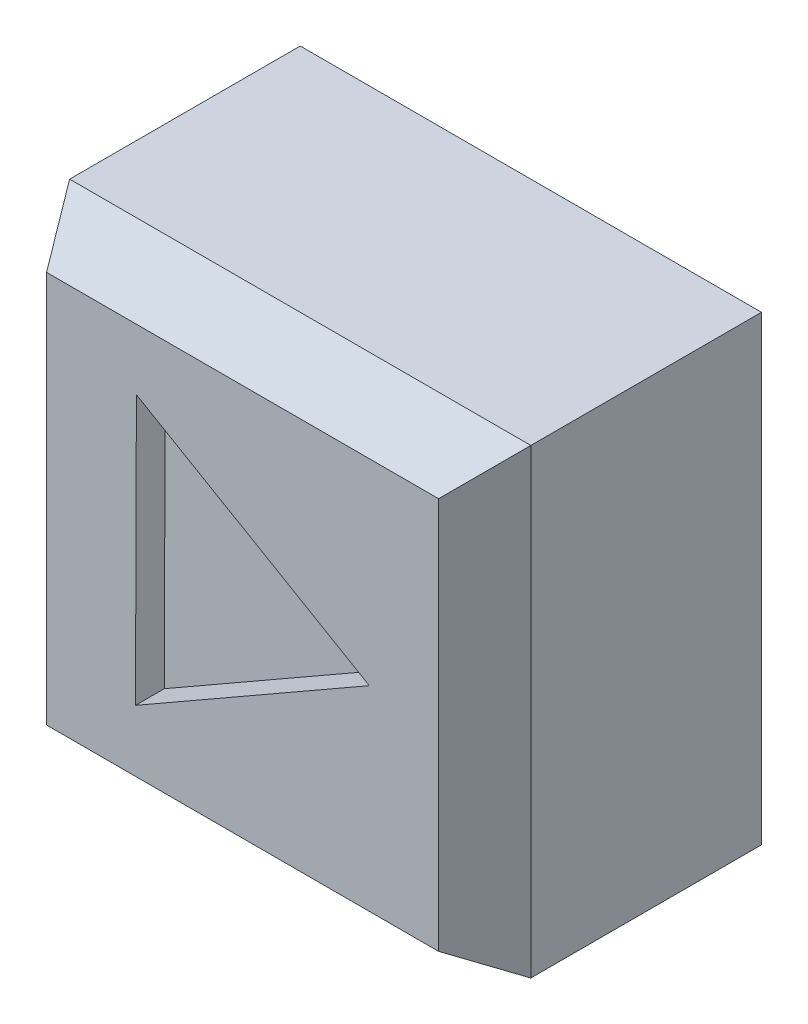
ISO-10303-21;
HEADER;
FILE_DESCRIPTION(('STEP AP214'),'2;1');
FILE_NAME('part.step','',(''),(''),'','','');
FILE_SCHEMA(('AUTOMOTIVE_DESIGN { 1 0 10303 214 1 1 1 1 }'));
ENDSEC;
DATA;
#1=APPLICATION_CONTEXT('core data for automotive mechanical design processes');
#2=APPLICATION_PROTOCOL_DEFINITION('international standard','automotive_design',2000,#1);
#3=PRODUCT_CONTEXT('',#1,'mechanical');
#4=PRODUCT('Part','Part','',(#3));
#5=PRODUCT_RELATED_PRODUCT_CATEGORY('part','',(#4));
#6=PRODUCT_DEFINITION_FORMATION('','',#4);
#7=PRODUCT_DEFINITION_CONTEXT('part definition',#1,'design');
#8=PRODUCT_DEFINITION('design','',#6,#7);
#9=PRODUCT_DEFINITION_SHAPE('','',#8);
#10=(LENGTH_UNIT() NAMED_UNIT(*) SI_UNIT(.MILLI.,.METRE.));
#11=(NAMED_UNIT(*) PLANE_ANGLE_UNIT() SI_UNIT($,.RADIAN.));
#12=(NAMED_UNIT(*) SI_UNIT($,.STERADIAN.) SOLID_ANGLE_UNIT());
#13=UNCERTAINTY_MEASURE_WITH_UNIT(LENGTH_MEASURE(1.E-05),#10,'distance_accuracy_value','');
#14=(GEOMETRIC_REPRESENTATION_CONTEXT(3) GLOBAL_UNCERTAINTY_ASSIGNED_CONTEXT((#13)) GLOBAL_UNIT_ASSIGNED_CONTEXT((#10,
#11,#12)) REPRESENTATION_CONTEXT('',''));
#15=CARTESIAN_POINT('',(0.,0.,0.));
#16=DIRECTION('',(0.,0.,1.));
#17=DIRECTION('',(1.,0.,0.));
#18=AXIS2_PLACEMENT_3D('',#15,#16,#17);
#19=CARTESIAN_POINT('',(0.,0.,10.));
#20=DIRECTION('',(1.,0.,0.));
#21=DIRECTION('',(0.,0.,-1.));
#22=AXIS2_PLACEMENT_3D('',#19,#20,#21);
#23=PLANE('',#22);
#24=DIRECTION('',(0.,0.,-1.));
#25=VECTOR('',#24,1.);
#26=CARTESIAN_POINT('',(0.,0.,10.));
#27=LINE('',#26,#25);
#28=CARTESIAN_POINT('',(0.,0.,8.));
#29=VERTEX_POINT('',#28);
#30=CARTESIAN_POINT('',(0.,0.,0.));
#31=VERTEX_POINT('',#30);
#32=EDGE_CURVE('E188',#29,#31,#27,.T.);
#33=ORIENTED_EDGE('',*,*,#32,.F.);
#34=DIRECTION('',(0.,1.,0.));
#35=VECTOR('',#34,1.);
#36=CARTESIAN_POINT('',(0.,0.,8.));
#37=LINE('',#36,#35);
#38=CARTESIAN_POINT('',(0.,16.,8.));
#39=VERTEX_POINT('',#38);
#40=EDGE_CURVE('E13',#29,#39,#37,.T.);
#41=ORIENTED_EDGE('',*,*,#40,.T.);
#42=DIRECTION('',(0.,0.,-1.));
#43=VECTOR('',#42,1.);
#44=CARTESIAN_POINT('',(0.,16.,10.));
#45=LINE('',#44,#43);
#46=CARTESIAN_POINT('',(0.,16.,0.));
#47=VERTEX_POINT('',#46);
#48=EDGE_CURVE('E179',#39,#47,#45,.T.);
#49=ORIENTED_EDGE('',*,*,#48,.T.);
#50=DIRECTION('',(0.,-1.,0.));
#51=VECTOR('',#50,1.);
#52=CARTESIAN_POINT('',(0.,0.,0.));
#53=LINE('',#52,#51);
#54=EDGE_CURVE('E161',#47,#31,#53,.T.);
#55=ORIENTED_EDGE('',*,*,#54,.T.);
#56=EDGE_LOOP('',(#33,#41,#49,#55));
#57=FACE_BOUND('',#56,.T.);
#58=ADVANCED_FACE('F48',(#57),#23,.F.);
#59=CARTESIAN_POINT('',(0.,0.,10.));
#60=DIRECTION('',(0.,1.,0.));
#61=DIRECTION('',(0.,0.,1.));
#62=AXIS2_PLACEMENT_3D('',#59,#60,#61);
#63=PLANE('',#62);
#64=DIRECTION('',(0.,0.,-1.));
#65=VECTOR('',#64,1.);
#66=CARTESIAN_POINT('',(16.,0.,10.));
#67=LINE('',#66,#65);
#68=CARTESIAN_POINT('',(16.,0.,8.));
#69=VERTEX_POINT('',#68);
#70=CARTESIAN_POINT('',(16.,0.,0.));
#71=VERTEX_POINT('',#70);
#72=EDGE_CURVE('E185',#69,#71,#67,.T.);
#73=ORIENTED_EDGE('',*,*,#72,.F.);
#74=DIRECTION('',(-1.,0.,0.));
#75=VECTOR('',#74,1.);
#76=CARTESIAN_POINT('',(0.,0.,8.));
#77=LINE('',#76,#75);
#78=EDGE_CURVE('E204',#69,#29,#77,.T.);
#79=ORIENTED_EDGE('',*,*,#78,.T.);
#80=ORIENTED_EDGE('',*,*,#32,.T.);
#81=DIRECTION('',(1.,0.,0.));
#82=VECTOR('',#81,1.);
#83=CARTESIAN_POINT('',(0.,0.,0.));
#84=LINE('',#83,#82);
#85=EDGE_CURVE('E167',#31,#71,#84,.T.);
#86=ORIENTED_EDGE('',*,*,#85,.T.);
#87=EDGE_LOOP('',(#73,#79,#80,#86));
#88=FACE_BOUND('',#87,.T.);
#89=ADVANCED_FACE('F241',(#88),#63,.F.);
#90=CARTESIAN_POINT('',(16.,0.,10.));
#91=DIRECTION('',(-1.,0.,0.));
#92=DIRECTION('',(0.,0.,1.));
#93=AXIS2_PLACEMENT_3D('',#90,#91,#92);
#94=PLANE('',#93);
#95=DIRECTION('',(0.,0.,-1.));
#96=VECTOR('',#95,1.);
#97=CARTESIAN_POINT('',(16.,16.,10.));
#98=LINE('',#97,#96);
#99=CARTESIAN_POINT('',(16.,16.,8.));
#100=VERTEX_POINT('',#99);
#101=CARTESIAN_POINT('',(16.,16.,0.));
#102=VERTEX_POINT('',#101);
#103=EDGE_CURVE('E182',#100,#102,#98,.T.);
#104=ORIENTED_EDGE('',*,*,#103,.F.);
#105=DIRECTION('',(0.,-1.,0.));
#106=VECTOR('',#105,1.);
#107=CARTESIAN_POINT('',(16.,0.,8.));
#108=LINE('',#107,#106);
#109=EDGE_CURVE('E208',#100,#69,#108,.T.);
#110=ORIENTED_EDGE('',*,*,#109,.T.);
#111=ORIENTED_EDGE('',*,*,#72,.T.);
#112=DIRECTION('',(0.,1.,0.));
#113=VECTOR('',#112,1.);
#114=CARTESIAN_POINT('',(16.,0.,0.));
#115=LINE('',#114,#113);
#116=EDGE_CURVE('E171',#71,#102,#115,.T.);
#117=ORIENTED_EDGE('',*,*,#116,.T.);
#118=EDGE_LOOP('',(#104,#110,#111,#117));
#119=FACE_BOUND('',#118,.T.);
#120=ADVANCED_FACE('F238',(#119),#94,.F.);
#121=CARTESIAN_POINT('',(0.,16.,10.));
#122=DIRECTION('',(0.,-1.,0.));
#123=DIRECTION('',(0.,0.,-1.));
#124=AXIS2_PLACEMENT_3D('',#121,#122,#123);
#125=PLANE('',#124);
#126=ORIENTED_EDGE('',*,*,#48,.F.);
#127=DIRECTION('',(1.,0.,0.));
#128=VECTOR('',#127,1.);
#129=CARTESIAN_POINT('',(0.,16.,8.));
#130=LINE('',#129,#128);
#131=EDGE_CURVE('E59',#39,#100,#130,.T.);
#132=ORIENTED_EDGE('',*,*,#131,.T.);
#133=ORIENTED_EDGE('',*,*,#103,.T.);
#134=DIRECTION('',(-1.,0.,0.));
#135=VECTOR('',#134,1.);
#136=CARTESIAN_POINT('',(0.,16.,0.));
#137=LINE('',#136,#135);
#138=EDGE_CURVE('E175',#102,#47,#137,.T.);
#139=ORIENTED_EDGE('',*,*,#138,.T.);
#140=EDGE_LOOP('',(#126,#132,#133,#139));
#141=FACE_BOUND('',#140,.T.);
#142=ADVANCED_FACE('F252',(#141),#125,.F.);
#143=CARTESIAN_POINT('',(0.,0.,10.));
#144=DIRECTION('',(0.,0.,-1.));
#145=DIRECTION('',(-1.,0.,0.));
#146=AXIS2_PLACEMENT_3D('',#143,#144,#145);
#147=PLANE('',#146);
#148=DIRECTION('',(0.,-1.,0.));
#149=VECTOR('',#148,1.);
#150=CARTESIAN_POINT('',(1.2,0.,10.));
#151=LINE('',#150,#149);
#152=CARTESIAN_POINT('',(1.2,14.8,10.));
#153=VERTEX_POINT('',#152);
#154=CARTESIAN_POINT('',(1.2,1.2,10.));
#155=VERTEX_POINT('',#154);
#156=EDGE_CURVE('E191',#153,#155,#151,.T.);
#157=ORIENTED_EDGE('',*,*,#156,.T.);
#158=DIRECTION('',(1.,0.,0.));
#159=VECTOR('',#158,1.);
#160=CARTESIAN_POINT('',(0.,1.2,10.));
#161=LINE('',#160,#159);
#162=CARTESIAN_POINT('',(14.8,1.2,10.));
#163=VERTEX_POINT('',#162);
#164=EDGE_CURVE('E200',#155,#163,#161,.T.);
#165=ORIENTED_EDGE('',*,*,#164,.T.);
#166=DIRECTION('',(0.,1.,0.));
#167=VECTOR('',#166,1.);
#168=CARTESIAN_POINT('',(14.8,0.,10.));
#169=LINE('',#168,#167);
#170=CARTESIAN_POINT('',(14.8,14.8,10.));
#171=VERTEX_POINT('',#170);
#172=EDGE_CURVE('E197',#163,#171,#169,.T.);
#173=ORIENTED_EDGE('',*,*,#172,.T.);
#174=DIRECTION('',(-1.,0.,0.));
#175=VECTOR('',#174,1.);
#176=CARTESIAN_POINT('',(0.,14.8,10.));
#177=LINE('',#176,#175);
#178=EDGE_CURVE('E194',#171,#153,#177,.T.);
#179=ORIENTED_EDGE('',*,*,#178,.T.);
#180=EDGE_LOOP('',(#157,#165,#173,#179));
#181=FACE_BOUND('',#180,.T.);
#182=DIRECTION('',(-0.00335376071122028,-0.999994376128732,0.));
#183=VECTOR('',#182,1.);
#184=CARTESIAN_POINT('',(4.31639020285282,12.6843598075923,10.));
#185=LINE('',#184,#183);
#186=CARTESIAN_POINT('',(4.31639020285282,12.6843598075923,10.));
#187=VERTEX_POINT('',#186);
#188=CARTESIAN_POINT('',(4.28503030473188,3.3337458380296,10.));
#189=VERTEX_POINT('',#188);
#190=EDGE_CURVE('E149',#187,#189,#185,.T.);
#191=ORIENTED_EDGE('',*,*,#190,.F.);
#192=DIRECTION('',(-0.864343653013443,0.502901630038497,0.));
#193=VECTOR('',#192,1.);
#194=CARTESIAN_POINT('',(12.3985794924153,7.98189435437812,10.));
#195=LINE('',#194,#193);
#196=CARTESIAN_POINT('',(12.3985794924153,7.98189435437812,10.));
#197=VERTEX_POINT('',#196);
#198=EDGE_CURVE('E128',#197,#187,#195,.T.);
#199=ORIENTED_EDGE('',*,*,#198,.F.);
#200=DIRECTION('',(0.867697413724663,0.497092746090235,0.));
#201=VECTOR('',#200,1.);
#202=CARTESIAN_POINT('',(4.28503030473188,3.3337458380296,10.));
#203=LINE('',#202,#201);
#204=EDGE_CURVE('E145',#189,#197,#203,.T.);
#205=ORIENTED_EDGE('',*,*,#204,.F.);
#206=EDGE_LOOP('',(#191,#199,#205));
#207=FACE_BOUND('',#206,.T.);
#208=ADVANCED_FACE('F248',(#181,#207),#147,.F.);
#209=CARTESIAN_POINT('',(0.,0.,0.));
#210=DIRECTION('',(0.,0.,-1.));
#211=DIRECTION('',(-1.,0.,0.));
#212=AXIS2_PLACEMENT_3D('',#209,#210,#211);
#213=PLANE('',#212);
#214=ORIENTED_EDGE('',*,*,#54,.F.);
#215=ORIENTED_EDGE('',*,*,#138,.F.);
#216=ORIENTED_EDGE('',*,*,#116,.F.);
#217=ORIENTED_EDGE('',*,*,#85,.F.);
#218=EDGE_LOOP('',(#214,#215,#216,#217));
#219=FACE_BOUND('',#218,.T.);
#220=ADVANCED_FACE('F251',(#219),#213,.T.);
#221=CARTESIAN_POINT('',(12.3985794924153,7.98189435437812,9.));
#222=DIRECTION('',(0.502901630038497,0.864343653013443,0.));
#223=DIRECTION('',(-0.864343653013443,0.502901630038497,0.));
#224=AXIS2_PLACEMENT_3D('',#221,#222,#223);
#225=PLANE('',#224);
#226=ORIENTED_EDGE('',*,*,#198,.T.);
#227=DIRECTION('',(0.,0.,1.));
#228=VECTOR('',#227,1.);
#229=CARTESIAN_POINT('',(4.31639020285282,12.6843598075923,9.));
#230=LINE('',#229,#228);
#231=CARTESIAN_POINT('',(4.31639020285282,12.6843598075923,9.));
#232=VERTEX_POINT('',#231);
#233=EDGE_CURVE('E121',#232,#187,#230,.T.);
#234=ORIENTED_EDGE('',*,*,#233,.F.);
#235=DIRECTION('',(-0.864343653013443,0.502901630038497,0.));
#236=VECTOR('',#235,1.);
#237=CARTESIAN_POINT('',(12.3985794924153,7.98189435437812,9.));
#238=LINE('',#237,#236);
#239=CARTESIAN_POINT('',(12.3985794924153,7.98189435437812,9.));
#240=VERTEX_POINT('',#239);
#241=EDGE_CURVE('E125',#240,#232,#238,.T.);
#242=ORIENTED_EDGE('',*,*,#241,.F.);
#243=DIRECTION('',(0.,0.,1.));
#244=VECTOR('',#243,1.);
#245=CARTESIAN_POINT('',(12.3985794924153,7.98189435437812,9.));
#246=LINE('',#245,#244);
#247=EDGE_CURVE('E158',#240,#197,#246,.T.);
#248=ORIENTED_EDGE('',*,*,#247,.T.);
#249=EDGE_LOOP('',(#226,#234,#242,#248));
#250=FACE_BOUND('',#249,.T.);
#251=ADVANCED_FACE('F123',(#250),#225,.F.);
#252=CARTESIAN_POINT('',(4.28503030473188,3.3337458380296,9.));
#253=DIRECTION('',(0.497092746090235,-0.867697413724663,0.));
#254=DIRECTION('',(0.867697413724663,0.497092746090235,0.));
#255=AXIS2_PLACEMENT_3D('',#252,#253,#254);
#256=PLANE('',#255);
#257=ORIENTED_EDGE('',*,*,#204,.T.);
#258=ORIENTED_EDGE('',*,*,#247,.F.);
#259=DIRECTION('',(0.867697413724663,0.497092746090235,0.));
#260=VECTOR('',#259,1.);
#261=CARTESIAN_POINT('',(4.28503030473188,3.3337458380296,9.));
#262=LINE('',#261,#260);
#263=CARTESIAN_POINT('',(4.28503030473188,3.3337458380296,9.));
#264=VERTEX_POINT('',#263);
#265=EDGE_CURVE('E134',#264,#240,#262,.T.);
#266=ORIENTED_EDGE('',*,*,#265,.F.);
#267=DIRECTION('',(0.,0.,1.));
#268=VECTOR('',#267,1.);
#269=CARTESIAN_POINT('',(4.28503030473188,3.3337458380296,9.));
#270=LINE('',#269,#268);
#271=EDGE_CURVE('E133',#264,#189,#270,.T.);
#272=ORIENTED_EDGE('',*,*,#271,.T.);
#273=EDGE_LOOP('',(#257,#258,#266,#272));
#274=FACE_BOUND('',#273,.T.);
#275=ADVANCED_FACE('F256',(#274),#256,.F.);
#276=CARTESIAN_POINT('',(4.31639020285282,12.6843598075923,9.));
#277=DIRECTION('',(-0.999994376128732,0.00335376071122028,0.));
#278=DIRECTION('',(-0.00335376071122028,-0.999994376128732,0.));
#279=AXIS2_PLACEMENT_3D('',#276,#277,#278);
#280=PLANE('',#279);
#281=ORIENTED_EDGE('',*,*,#190,.T.);
#282=ORIENTED_EDGE('',*,*,#271,.F.);
#283=DIRECTION('',(-0.00335376071122028,-0.999994376128732,0.));
#284=VECTOR('',#283,1.);
#285=CARTESIAN_POINT('',(4.31639020285282,12.6843598075923,9.));
#286=LINE('',#285,#284);
#287=EDGE_CURVE('E137',#232,#264,#286,.T.);
#288=ORIENTED_EDGE('',*,*,#287,.F.);
#289=ORIENTED_EDGE('',*,*,#233,.T.);
#290=EDGE_LOOP('',(#281,#282,#288,#289));
#291=FACE_BOUND('',#290,.T.);
#292=ADVANCED_FACE('F138',(#291),#280,.F.);
#293=CARTESIAN_POINT('',(0.,0.,9.));
#294=DIRECTION('',(0.,0.,1.));
#295=DIRECTION('',(1.,0.,0.));
#296=AXIS2_PLACEMENT_3D('',#293,#294,#295);
#297=PLANE('',#296);
#298=ORIENTED_EDGE('',*,*,#241,.T.);
#299=ORIENTED_EDGE('',*,*,#287,.T.);
#300=ORIENTED_EDGE('',*,*,#265,.T.);
#301=EDGE_LOOP('',(#298,#299,#300));
#302=FACE_BOUND('',#301,.T.);
#303=ADVANCED_FACE('F143',(#302),#297,.T.);
#304=CARTESIAN_POINT('',(0.,14.8,10.));
#305=DIRECTION('',(0.,-0.857492925712544,-0.514495755427526));
#306=DIRECTION('',(-1.,0.,0.));
#307=AXIS2_PLACEMENT_3D('',#304,#305,#306);
#308=PLANE('',#307);
#309=DIRECTION('',(0.457495710997814,0.457495710997814,-0.762492851663023));
#310=VECTOR('',#309,1.);
#311=CARTESIAN_POINT('',(11.7023255813953,11.7023255813954,15.1627906976744));
#312=LINE('',#311,#310);
#313=EDGE_CURVE('E218',#100,#171,#312,.F.);
#314=ORIENTED_EDGE('',*,*,#313,.F.);
#315=ORIENTED_EDGE('',*,*,#131,.F.);
#316=DIRECTION('',(-0.457495710997814,0.457495710997814,-0.762492851663023));
#317=VECTOR('',#316,1.);
#318=CARTESIAN_POINT('',(4.29767441860465,11.7023255813954,15.1627906976744));
#319=LINE('',#318,#317);
#320=EDGE_CURVE('E53',#153,#39,#319,.T.);
#321=ORIENTED_EDGE('',*,*,#320,.F.);
#322=ORIENTED_EDGE('',*,*,#178,.F.);
#323=EDGE_LOOP('',(#314,#315,#321,#322));
#324=FACE_BOUND('',#323,.T.);
#325=ADVANCED_FACE('F51',(#324),#308,.F.);
#326=CARTESIAN_POINT('',(1.2,0.,10.));
#327=DIRECTION('',(0.857492925712544,0.,-0.514495755427526));
#328=DIRECTION('',(0.,-1.,0.));
#329=AXIS2_PLACEMENT_3D('',#326,#327,#328);
#330=PLANE('',#329);
#331=ORIENTED_EDGE('',*,*,#320,.T.);
#332=ORIENTED_EDGE('',*,*,#40,.F.);
#333=DIRECTION('',(0.457495710997814,0.457495710997814,0.762492851663023));
#334=VECTOR('',#333,1.);
#335=CARTESIAN_POINT('',(0.948837209302326,0.948837209302325,9.58139534883721));
#336=LINE('',#335,#334);
#337=EDGE_CURVE('E216',#155,#29,#336,.F.);
#338=ORIENTED_EDGE('',*,*,#337,.F.);
#339=ORIENTED_EDGE('',*,*,#156,.F.);
#340=EDGE_LOOP('',(#331,#332,#338,#339));
#341=FACE_BOUND('',#340,.T.);
#342=ADVANCED_FACE('F230',(#341),#330,.F.);
#343=CARTESIAN_POINT('',(14.8,0.,10.));
#344=DIRECTION('',(-0.857492925712544,0.,-0.514495755427526));
#345=DIRECTION('',(0.,1.,0.));
#346=AXIS2_PLACEMENT_3D('',#343,#344,#345);
#347=PLANE('',#346);
#348=ORIENTED_EDGE('',*,*,#313,.T.);
#349=ORIENTED_EDGE('',*,*,#172,.F.);
#350=DIRECTION('',(0.457495710997814,-0.457495710997814,-0.762492851663023));
#351=VECTOR('',#350,1.);
#352=CARTESIAN_POINT('',(15.0511627906977,0.948837209302326,9.58139534883721));
#353=LINE('',#352,#351);
#354=EDGE_CURVE('E213',#69,#163,#353,.F.);
#355=ORIENTED_EDGE('',*,*,#354,.F.);
#356=ORIENTED_EDGE('',*,*,#109,.F.);
#357=EDGE_LOOP('',(#348,#349,#355,#356));
#358=FACE_BOUND('',#357,.T.);
#359=ADVANCED_FACE('F235',(#358),#347,.F.);
#360=CARTESIAN_POINT('',(0.,1.2,10.));
#361=DIRECTION('',(0.,0.857492925712544,-0.514495755427526));
#362=DIRECTION('',(1.,0.,0.));
#363=AXIS2_PLACEMENT_3D('',#360,#361,#362);
#364=PLANE('',#363);
#365=ORIENTED_EDGE('',*,*,#337,.T.);
#366=ORIENTED_EDGE('',*,*,#78,.F.);
#367=ORIENTED_EDGE('',*,*,#354,.T.);
#368=ORIENTED_EDGE('',*,*,#164,.F.);
#369=EDGE_LOOP('',(#365,#366,#367,#368));
#370=FACE_BOUND('',#369,.T.);
#371=ADVANCED_FACE('F245',(#370),#364,.F.);
#372=CLOSED_SHELL('',(#58,#89,#120,#142,#208,#220,#251,#275,#292,#303,#325,#342,#359,#371));
#373=MANIFOLD_SOLID_BREP('B2',#372);
#374=ADVANCED_BREP_SHAPE_REPRESENTATION('',(#18,#373),#14);
#375=SHAPE_DEFINITION_REPRESENTATION(#9,#374);
ENDSEC;
END-ISO-10303-21;
